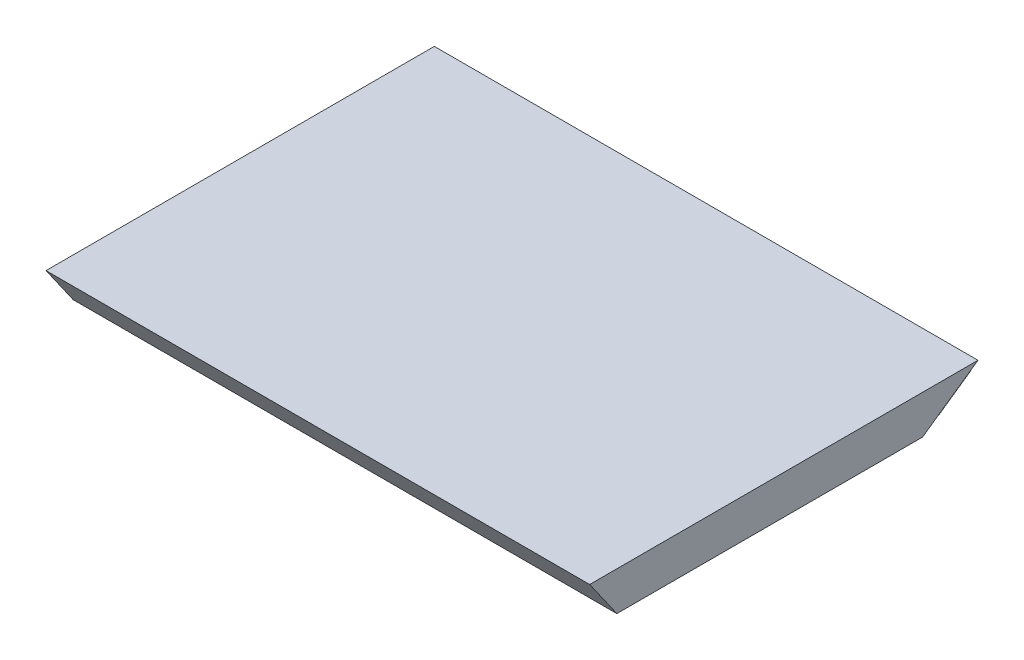
ISO-10303-21;
HEADER;
FILE_DESCRIPTION(('STEP AP214'),'2;1');
FILE_NAME('part.step','',(''),(''),'','','');
FILE_SCHEMA(('AUTOMOTIVE_DESIGN { 1 0 10303 214 1 1 1 1 }'));
ENDSEC;
DATA;
#1=APPLICATION_CONTEXT('core data for automotive mechanical design processes');
#2=APPLICATION_PROTOCOL_DEFINITION('international standard','automotive_design',2000,#1);
#3=PRODUCT_CONTEXT('',#1,'mechanical');
#4=PRODUCT('Part','Part','',(#3));
#5=PRODUCT_RELATED_PRODUCT_CATEGORY('part','',(#4));
#6=PRODUCT_DEFINITION_FORMATION('','',#4);
#7=PRODUCT_DEFINITION_CONTEXT('part definition',#1,'design');
#8=PRODUCT_DEFINITION('design','',#6,#7);
#9=PRODUCT_DEFINITION_SHAPE('','',#8);
#10=(LENGTH_UNIT() NAMED_UNIT(*) SI_UNIT(.MILLI.,.METRE.));
#11=(NAMED_UNIT(*) PLANE_ANGLE_UNIT() SI_UNIT($,.RADIAN.));
#12=(NAMED_UNIT(*) SI_UNIT($,.STERADIAN.) SOLID_ANGLE_UNIT());
#13=UNCERTAINTY_MEASURE_WITH_UNIT(LENGTH_MEASURE(1.E-05),#10,'distance_accuracy_value','');
#14=(GEOMETRIC_REPRESENTATION_CONTEXT(3) GLOBAL_UNCERTAINTY_ASSIGNED_CONTEXT((#13)) GLOBAL_UNIT_ASSIGNED_CONTEXT((#10,
#11,#12)) REPRESENTATION_CONTEXT('',''));
#15=CARTESIAN_POINT('',(0.,0.,0.));
#16=DIRECTION('',(0.,0.,1.));
#17=DIRECTION('',(1.,0.,0.));
#18=AXIS2_PLACEMENT_3D('',#15,#16,#17);
#19=CARTESIAN_POINT('',(44.45,3.175,0.));
#20=DIRECTION('',(0.,1.,0.));
#21=DIRECTION('',(0.,0.,1.));
#22=AXIS2_PLACEMENT_3D('',#19,#20,#21);
#23=PLANE('',#22);
#24=DIRECTION('',(0.,0.,-1.));
#25=VECTOR('',#24,1.);
#26=CARTESIAN_POINT('',(-44.45,3.175,0.));
#27=LINE('',#26,#25);
#28=CARTESIAN_POINT('',(-44.45,3.175,31.75));
#29=VERTEX_POINT('',#28);
#30=CARTESIAN_POINT('',(-44.45,3.175,-31.75));
#31=VERTEX_POINT('',#30);
#32=EDGE_CURVE('E121',#29,#31,#27,.T.);
#33=ORIENTED_EDGE('',*,*,#32,.F.);
#34=DIRECTION('',(-1.,0.,0.));
#35=VECTOR('',#34,1.);
#36=CARTESIAN_POINT('',(44.45,3.175,31.75));
#37=LINE('',#36,#35);
#38=CARTESIAN_POINT('',(44.45,3.175,31.75));
#39=VERTEX_POINT('',#38);
#40=EDGE_CURVE('E11',#39,#29,#37,.T.);
#41=ORIENTED_EDGE('',*,*,#40,.F.);
#42=DIRECTION('',(0.,0.,-1.));
#43=VECTOR('',#42,1.);
#44=CARTESIAN_POINT('',(44.45,3.175,0.));
#45=LINE('',#44,#43);
#46=CARTESIAN_POINT('',(44.45,3.175,-31.75));
#47=VERTEX_POINT('',#46);
#48=EDGE_CURVE('E170',#39,#47,#45,.T.);
#49=ORIENTED_EDGE('',*,*,#48,.T.);
#50=DIRECTION('',(-1.,0.,0.));
#51=VECTOR('',#50,1.);
#52=CARTESIAN_POINT('',(44.45,3.175,-31.75));
#53=LINE('',#52,#51);
#54=CARTESIAN_POINT('',(38.1,3.175,-31.75));
#55=VERTEX_POINT('',#54);
#56=EDGE_CURVE('E143',#47,#55,#53,.T.);
#57=ORIENTED_EDGE('',*,*,#56,.T.);
#58=DIRECTION('',(1.,0.,0.));
#59=VECTOR('',#58,1.);
#60=CARTESIAN_POINT('',(-38.1,3.175,-31.75));
#61=LINE('',#60,#59);
#62=CARTESIAN_POINT('',(-38.1,3.175,-31.75));
#63=VERTEX_POINT('',#62);
#64=EDGE_CURVE('E134',#63,#55,#61,.T.);
#65=ORIENTED_EDGE('',*,*,#64,.F.);
#66=EDGE_CURVE('E55',#63,#31,#53,.T.);
#67=ORIENTED_EDGE('',*,*,#66,.T.);
#68=EDGE_LOOP('',(#33,#41,#49,#57,#65,#67));
#69=FACE_BOUND('',#68,.T.);
#70=ADVANCED_FACE('F34',(#69),#23,.T.);
#71=CARTESIAN_POINT('',(44.45,-13.8730773325058,19.8128077397973));
#72=DIRECTION('',(0.,0.573576436351047,-0.819152044288991));
#73=DIRECTION('',(0.,0.819152044288991,0.573576436351047));
#74=AXIS2_PLACEMENT_3D('',#71,#72,#73);
#75=PLANE('',#74);
#76=DIRECTION('',(0.,-0.819152044288991,-0.573576436351047));
#77=VECTOR('',#76,1.);
#78=CARTESIAN_POINT('',(-44.45,-13.8730773325058,19.8128077397973));
#79=LINE('',#78,#77);
#80=CARTESIAN_POINT('',(-44.45,-3.175,27.3036821323683));
#81=VERTEX_POINT('',#80);
#82=EDGE_CURVE('E124',#29,#81,#79,.T.);
#83=ORIENTED_EDGE('',*,*,#82,.T.);
#84=DIRECTION('',(-1.,0.,0.));
#85=VECTOR('',#84,1.);
#86=CARTESIAN_POINT('',(44.45,-3.175,27.3036821323683));
#87=LINE('',#86,#85);
#88=CARTESIAN_POINT('',(44.45,-3.175,27.3036821323683));
#89=VERTEX_POINT('',#88);
#90=EDGE_CURVE('E43',#89,#81,#87,.T.);
#91=ORIENTED_EDGE('',*,*,#90,.F.);
#92=DIRECTION('',(0.,-0.819152044288991,-0.573576436351047));
#93=VECTOR('',#92,1.);
#94=CARTESIAN_POINT('',(44.45,-13.8730773325058,19.8128077397973));
#95=LINE('',#94,#93);
#96=EDGE_CURVE('E176',#39,#89,#95,.T.);
#97=ORIENTED_EDGE('',*,*,#96,.F.);
#98=ORIENTED_EDGE('',*,*,#40,.T.);
#99=EDGE_LOOP('',(#83,#91,#97,#98));
#100=FACE_BOUND('',#99,.T.);
#101=ADVANCED_FACE('F199',(#100),#75,.F.);
#102=CARTESIAN_POINT('',(44.45,-3.175,0.));
#103=DIRECTION('',(0.,1.,0.));
#104=DIRECTION('',(0.,0.,1.));
#105=AXIS2_PLACEMENT_3D('',#102,#103,#104);
#106=PLANE('',#105);
#107=DIRECTION('',(0.,0.,-1.));
#108=VECTOR('',#107,1.);
#109=CARTESIAN_POINT('',(-44.45,-3.175,0.));
#110=LINE('',#109,#108);
#111=CARTESIAN_POINT('',(-44.45,-3.175,-22.6812601571875));
#112=VERTEX_POINT('',#111);
#113=EDGE_CURVE('E161',#81,#112,#110,.T.);
#114=ORIENTED_EDGE('',*,*,#113,.T.);
#115=DIRECTION('',(-1.,0.,0.));
#116=VECTOR('',#115,1.);
#117=CARTESIAN_POINT('',(44.45,-3.175,-22.6812601571875));
#118=LINE('',#117,#116);
#119=CARTESIAN_POINT('',(44.45,-3.175,-22.6812601571875));
#120=VERTEX_POINT('',#119);
#121=EDGE_CURVE('E150',#120,#112,#118,.T.);
#122=ORIENTED_EDGE('',*,*,#121,.F.);
#123=DIRECTION('',(0.,0.,-1.));
#124=VECTOR('',#123,1.);
#125=CARTESIAN_POINT('',(44.45,-3.175,0.));
#126=LINE('',#125,#124);
#127=EDGE_CURVE('E163',#89,#120,#126,.T.);
#128=ORIENTED_EDGE('',*,*,#127,.F.);
#129=ORIENTED_EDGE('',*,*,#90,.T.);
#130=EDGE_LOOP('',(#114,#122,#128,#129));
#131=FACE_BOUND('',#130,.T.);
#132=ADVANCED_FACE('F159',(#131),#106,.F.);
#133=CARTESIAN_POINT('',(44.45,-12.7871633774467,-8.95366818920722));
#134=DIRECTION('',(0.,-0.819152044288995,-0.573576436351042));
#135=DIRECTION('',(0.,0.573576436351042,-0.819152044288995));
#136=AXIS2_PLACEMENT_3D('',#133,#134,#135);
#137=PLANE('',#136);
#138=DIRECTION('',(0.,0.573576436351042,-0.819152044288995));
#139=VECTOR('',#138,1.);
#140=CARTESIAN_POINT('',(-38.1,-0.467210370829113,-26.5483845187649));
#141=LINE('',#140,#139);
#142=CARTESIAN_POINT('',(-38.1,-0.467210370829113,-26.5483845187649));
#143=VERTEX_POINT('',#142);
#144=EDGE_CURVE('E37',#143,#63,#141,.T.);
#145=ORIENTED_EDGE('',*,*,#144,.F.);
#146=DIRECTION('',(-1.,0.,0.));
#147=VECTOR('',#146,1.);
#148=CARTESIAN_POINT('',(-38.1,-0.467210370829113,-26.5483845187649));
#149=LINE('',#148,#147);
#150=CARTESIAN_POINT('',(38.1,-0.467210370829113,-26.5483845187649));
#151=VERTEX_POINT('',#150);
#152=EDGE_CURVE('E118',#151,#143,#149,.T.);
#153=ORIENTED_EDGE('',*,*,#152,.F.);
#154=DIRECTION('',(0.,-0.573576436351042,0.819152044288995));
#155=VECTOR('',#154,1.);
#156=CARTESIAN_POINT('',(38.1,-0.467210370829113,-26.5483845187649));
#157=LINE('',#156,#155);
#158=EDGE_CURVE('E136',#55,#151,#157,.T.);
#159=ORIENTED_EDGE('',*,*,#158,.F.);
#160=ORIENTED_EDGE('',*,*,#56,.F.);
#161=DIRECTION('',(0.,-0.573576436351042,0.819152044288995));
#162=VECTOR('',#161,1.);
#163=CARTESIAN_POINT('',(44.45,-12.7871633774467,-8.95366818920722));
#164=LINE('',#163,#162);
#165=EDGE_CURVE('E144',#47,#120,#164,.T.);
#166=ORIENTED_EDGE('',*,*,#165,.T.);
#167=ORIENTED_EDGE('',*,*,#121,.T.);
#168=DIRECTION('',(0.,-0.573576436351042,0.819152044288995));
#169=VECTOR('',#168,1.);
#170=CARTESIAN_POINT('',(-44.45,-12.7871633774467,-8.95366818920722));
#171=LINE('',#170,#169);
#172=EDGE_CURVE('E148',#31,#112,#171,.T.);
#173=ORIENTED_EDGE('',*,*,#172,.F.);
#174=ORIENTED_EDGE('',*,*,#66,.F.);
#175=EDGE_LOOP('',(#145,#153,#159,#160,#166,#167,#173,#174));
#176=FACE_BOUND('',#175,.T.);
#177=ADVANCED_FACE('F192',(#176),#137,.T.);
#178=CARTESIAN_POINT('',(44.45,0.,0.));
#179=DIRECTION('',(1.,0.,0.));
#180=DIRECTION('',(0.,0.,-1.));
#181=AXIS2_PLACEMENT_3D('',#178,#179,#180);
#182=PLANE('',#181);
#183=ORIENTED_EDGE('',*,*,#48,.F.);
#184=ORIENTED_EDGE('',*,*,#96,.T.);
#185=ORIENTED_EDGE('',*,*,#127,.T.);
#186=ORIENTED_EDGE('',*,*,#165,.F.);
#187=EDGE_LOOP('',(#183,#184,#185,#186));
#188=FACE_BOUND('',#187,.T.);
#189=ADVANCED_FACE('F198',(#188),#182,.T.);
#190=CARTESIAN_POINT('',(-44.45,0.,0.));
#191=DIRECTION('',(1.,0.,0.));
#192=DIRECTION('',(0.,0.,-1.));
#193=AXIS2_PLACEMENT_3D('',#190,#191,#192);
#194=PLANE('',#193);
#195=ORIENTED_EDGE('',*,*,#32,.T.);
#196=ORIENTED_EDGE('',*,*,#172,.T.);
#197=ORIENTED_EDGE('',*,*,#113,.F.);
#198=ORIENTED_EDGE('',*,*,#82,.F.);
#199=EDGE_LOOP('',(#195,#196,#197,#198));
#200=FACE_BOUND('',#199,.T.);
#201=ADVANCED_FACE('F168',(#200),#194,.F.);
#202=CARTESIAN_POINT('',(-38.1,-7.74947204455828,-31.6474790379256));
#203=DIRECTION('',(1.,0.,0.));
#204=DIRECTION('',(0.,0.,-1.));
#205=AXIS2_PLACEMENT_3D('',#202,#203,#204);
#206=PLANE('',#205);
#207=ORIENTED_EDGE('',*,*,#144,.T.);
#208=DIRECTION('',(0.,0.819152044288995,0.573576436351042));
#209=VECTOR('',#208,1.);
#210=CARTESIAN_POINT('',(-38.1,-4.10726167372916,-36.8490945191608));
#211=LINE('',#210,#209);
#212=CARTESIAN_POINT('',(-38.1,-4.10726167372916,-36.8490945191608));
#213=VERTEX_POINT('',#212);
#214=EDGE_CURVE('E103',#213,#63,#211,.T.);
#215=ORIENTED_EDGE('',*,*,#214,.F.);
#216=DIRECTION('',(0.,0.573576436351042,-0.819152044288995));
#217=VECTOR('',#216,1.);
#218=CARTESIAN_POINT('',(-38.1,-7.74947204455828,-31.6474790379256));
#219=LINE('',#218,#217);
#220=CARTESIAN_POINT('',(-38.1,-7.74947204455828,-31.6474790379256));
#221=VERTEX_POINT('',#220);
#222=EDGE_CURVE('E109',#221,#213,#219,.T.);
#223=ORIENTED_EDGE('',*,*,#222,.F.);
#224=DIRECTION('',(0.,0.819152044288995,0.573576436351042));
#225=VECTOR('',#224,1.);
#226=CARTESIAN_POINT('',(-38.1,-7.74947204455828,-31.6474790379256));
#227=LINE('',#226,#225);
#228=EDGE_CURVE('E182',#221,#143,#227,.T.);
#229=ORIENTED_EDGE('',*,*,#228,.T.);
#230=EDGE_LOOP('',(#207,#215,#223,#229));
#231=FACE_BOUND('',#230,.T.);
#232=ADVANCED_FACE('F120',(#231),#206,.F.);
#233=CARTESIAN_POINT('',(-38.1,-4.10726167372916,-36.8490945191608));
#234=DIRECTION('',(0.,-0.573576436351042,0.819152044288995));
#235=DIRECTION('',(0.,-0.819152044288995,-0.573576436351042));
#236=AXIS2_PLACEMENT_3D('',#233,#234,#235);
#237=PLANE('',#236);
#238=ORIENTED_EDGE('',*,*,#64,.T.);
#239=DIRECTION('',(0.,0.819152044288995,0.573576436351042));
#240=VECTOR('',#239,1.);
#241=CARTESIAN_POINT('',(38.1,-4.10726167372916,-36.8490945191608));
#242=LINE('',#241,#240);
#243=CARTESIAN_POINT('',(38.1,-4.10726167372916,-36.8490945191608));
#244=VERTEX_POINT('',#243);
#245=EDGE_CURVE('E105',#244,#55,#242,.T.);
#246=ORIENTED_EDGE('',*,*,#245,.F.);
#247=DIRECTION('',(1.,0.,0.));
#248=VECTOR('',#247,1.);
#249=CARTESIAN_POINT('',(-38.1,-4.10726167372916,-36.8490945191608));
#250=LINE('',#249,#248);
#251=EDGE_CURVE('E98',#213,#244,#250,.T.);
#252=ORIENTED_EDGE('',*,*,#251,.F.);
#253=ORIENTED_EDGE('',*,*,#214,.T.);
#254=EDGE_LOOP('',(#238,#246,#252,#253));
#255=FACE_BOUND('',#254,.T.);
#256=ADVANCED_FACE('F101',(#255),#237,.F.);
#257=CARTESIAN_POINT('',(38.1,-7.74947204455828,-31.6474790379256));
#258=DIRECTION('',(-1.,0.,0.));
#259=DIRECTION('',(0.,0.,1.));
#260=AXIS2_PLACEMENT_3D('',#257,#258,#259);
#261=PLANE('',#260);
#262=ORIENTED_EDGE('',*,*,#158,.T.);
#263=DIRECTION('',(0.,0.819152044288995,0.573576436351042));
#264=VECTOR('',#263,1.);
#265=CARTESIAN_POINT('',(38.1,-7.74947204455828,-31.6474790379256));
#266=LINE('',#265,#264);
#267=CARTESIAN_POINT('',(38.1,-7.74947204455828,-31.6474790379256));
#268=VERTEX_POINT('',#267);
#269=EDGE_CURVE('E126',#268,#151,#266,.T.);
#270=ORIENTED_EDGE('',*,*,#269,.F.);
#271=DIRECTION('',(0.,-0.573576436351042,0.819152044288995));
#272=VECTOR('',#271,1.);
#273=CARTESIAN_POINT('',(38.1,-7.74947204455828,-31.6474790379256));
#274=LINE('',#273,#272);
#275=EDGE_CURVE('E108',#244,#268,#274,.T.);
#276=ORIENTED_EDGE('',*,*,#275,.F.);
#277=ORIENTED_EDGE('',*,*,#245,.T.);
#278=EDGE_LOOP('',(#262,#270,#276,#277));
#279=FACE_BOUND('',#278,.T.);
#280=ADVANCED_FACE('F189',(#279),#261,.F.);
#281=CARTESIAN_POINT('',(-38.1,-7.74947204455828,-31.6474790379256));
#282=DIRECTION('',(0.,0.573576436351042,-0.819152044288995));
#283=DIRECTION('',(0.,0.819152044288995,0.573576436351042));
#284=AXIS2_PLACEMENT_3D('',#281,#282,#283);
#285=PLANE('',#284);
#286=ORIENTED_EDGE('',*,*,#152,.T.);
#287=ORIENTED_EDGE('',*,*,#228,.F.);
#288=DIRECTION('',(-1.,0.,0.));
#289=VECTOR('',#288,1.);
#290=CARTESIAN_POINT('',(-38.1,-7.74947204455828,-31.6474790379256));
#291=LINE('',#290,#289);
#292=EDGE_CURVE('E114',#268,#221,#291,.T.);
#293=ORIENTED_EDGE('',*,*,#292,.F.);
#294=ORIENTED_EDGE('',*,*,#269,.T.);
#295=EDGE_LOOP('',(#286,#287,#293,#294));
#296=FACE_BOUND('',#295,.T.);
#297=ADVANCED_FACE('F191',(#296),#285,.F.);
#298=CARTESIAN_POINT('',(0.,-20.0694250511759,-14.052762708368));
#299=DIRECTION('',(0.,-0.819152044288995,-0.573576436351042));
#300=DIRECTION('',(0.,0.573576436351042,-0.819152044288995));
#301=AXIS2_PLACEMENT_3D('',#298,#299,#300);
#302=PLANE('',#301);
#303=ORIENTED_EDGE('',*,*,#222,.T.);
#304=ORIENTED_EDGE('',*,*,#251,.T.);
#305=ORIENTED_EDGE('',*,*,#275,.T.);
#306=ORIENTED_EDGE('',*,*,#292,.T.);
#307=EDGE_LOOP('',(#303,#304,#305,#306));
#308=FACE_BOUND('',#307,.T.);
#309=ADVANCED_FACE('F112',(#308),#302,.T.);
#310=CLOSED_SHELL('',(#70,#101,#132,#177,#189,#201,#232,#256,#280,#297,#309));
#311=MANIFOLD_SOLID_BREP('B2',#310);
#312=ADVANCED_BREP_SHAPE_REPRESENTATION('',(#18,#311),#14);
#313=SHAPE_DEFINITION_REPRESENTATION(#9,#312);
ENDSEC;
END-ISO-10303-21;
